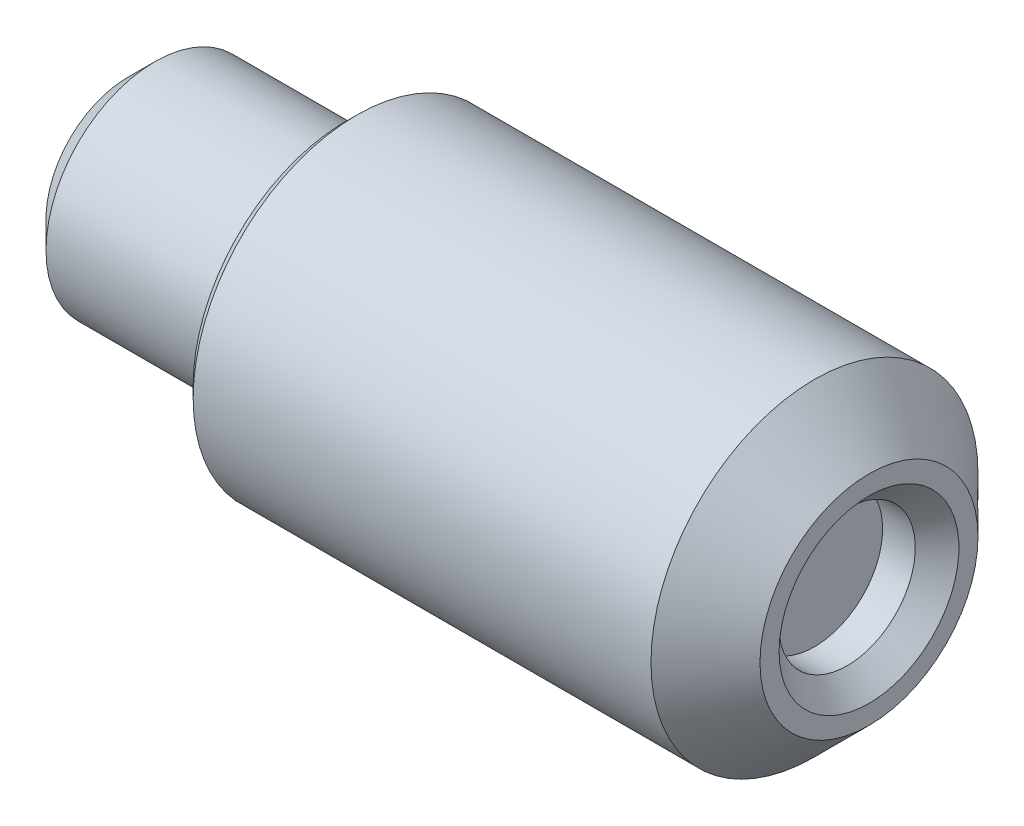
ISO-10303-21;
HEADER;
FILE_DESCRIPTION(('STEP AP214'),'2;1');
FILE_NAME('part.step','',(''),(''),'','','');
FILE_SCHEMA(('AUTOMOTIVE_DESIGN { 1 0 10303 214 1 1 1 1 }'));
ENDSEC;
DATA;
#1=APPLICATION_CONTEXT('core data for automotive mechanical design processes');
#2=APPLICATION_PROTOCOL_DEFINITION('international standard','automotive_design',2000,#1);
#3=PRODUCT_CONTEXT('',#1,'mechanical');
#4=PRODUCT('Part','Part','',(#3));
#5=PRODUCT_RELATED_PRODUCT_CATEGORY('part','',(#4));
#6=PRODUCT_DEFINITION_FORMATION('','',#4);
#7=PRODUCT_DEFINITION_CONTEXT('part definition',#1,'design');
#8=PRODUCT_DEFINITION('design','',#6,#7);
#9=PRODUCT_DEFINITION_SHAPE('','',#8);
#10=(LENGTH_UNIT() NAMED_UNIT(*) SI_UNIT(.MILLI.,.METRE.));
#11=(NAMED_UNIT(*) PLANE_ANGLE_UNIT() SI_UNIT($,.RADIAN.));
#12=(NAMED_UNIT(*) SI_UNIT($,.STERADIAN.) SOLID_ANGLE_UNIT());
#13=UNCERTAINTY_MEASURE_WITH_UNIT(LENGTH_MEASURE(1.E-05),#10,'distance_accuracy_value','');
#14=(GEOMETRIC_REPRESENTATION_CONTEXT(3) GLOBAL_UNCERTAINTY_ASSIGNED_CONTEXT((#13)) GLOBAL_UNIT_ASSIGNED_CONTEXT((#10,
#11,#12)) REPRESENTATION_CONTEXT('',''));
#15=CARTESIAN_POINT('',(0.,0.,0.));
#16=DIRECTION('',(0.,0.,1.));
#17=DIRECTION('',(1.,0.,0.));
#18=AXIS2_PLACEMENT_3D('',#15,#16,#17);
#19=CARTESIAN_POINT('',(-13.6,2.,0.));
#20=DIRECTION('',(1.,0.,0.));
#21=DIRECTION('',(0.,0.,-1.));
#22=AXIS2_PLACEMENT_3D('',#19,#20,#21);
#23=PLANE('',#22);
#24=CARTESIAN_POINT('',(-13.6,0.,0.));
#25=DIRECTION('',(1.,0.,0.));
#26=DIRECTION('',(0.,0.,-1.));
#27=AXIS2_PLACEMENT_3D('',#24,#25,#26);
#28=CIRCLE('',#27,1.5);
#29=CARTESIAN_POINT('',(-13.6,0.,-1.5));
#30=VERTEX_POINT('',#29);
#31=EDGE_CURVE('E31',#30,#30,#28,.F.);
#32=ORIENTED_EDGE('',*,*,#31,.T.);
#33=EDGE_LOOP('',(#32));
#34=FACE_BOUND('',#33,.T.);
#35=ADVANCED_FACE('F25',(#34),#23,.F.);
#36=CARTESIAN_POINT('',(0.,0.,0.));
#37=DIRECTION('',(-1.,0.,0.));
#38=DIRECTION('',(0.,0.,1.));
#39=AXIS2_PLACEMENT_3D('',#36,#37,#38);
#40=CYLINDRICAL_SURFACE('',#39,2.);
#41=CARTESIAN_POINT('',(-13.1,0.,0.));
#42=DIRECTION('',(1.,0.,0.));
#43=DIRECTION('',(0.,0.,-1.));
#44=AXIS2_PLACEMENT_3D('',#41,#42,#43);
#45=CIRCLE('',#44,2.);
#46=CARTESIAN_POINT('',(-13.1,0.,-2.));
#47=VERTEX_POINT('',#46);
#48=EDGE_CURVE('E10',#47,#47,#45,.T.);
#49=ORIENTED_EDGE('',*,*,#48,.T.);
#50=EDGE_LOOP('',(#49));
#51=FACE_BOUND('',#50,.T.);
#52=CARTESIAN_POINT('',(-9.6,0.,0.));
#53=DIRECTION('',(-1.,0.,0.));
#54=DIRECTION('',(0.,0.,1.));
#55=AXIS2_PLACEMENT_3D('',#52,#53,#54);
#56=CIRCLE('',#55,2.);
#57=CARTESIAN_POINT('',(-9.6,0.,2.));
#58=VERTEX_POINT('',#57);
#59=EDGE_CURVE('E56',#58,#58,#56,.T.);
#60=ORIENTED_EDGE('',*,*,#59,.T.);
#61=EDGE_LOOP('',(#60));
#62=FACE_BOUND('',#61,.T.);
#63=ADVANCED_FACE('F80',(#51,#62),#40,.T.);
#64=CARTESIAN_POINT('',(-9.6,3.,0.));
#65=DIRECTION('',(1.,0.,0.));
#66=DIRECTION('',(0.,0.,-1.));
#67=AXIS2_PLACEMENT_3D('',#64,#65,#66);
#68=PLANE('',#67);
#69=CARTESIAN_POINT('',(-9.6,0.,0.));
#70=DIRECTION('',(1.,0.,0.));
#71=DIRECTION('',(0.,0.,-1.));
#72=AXIS2_PLACEMENT_3D('',#69,#70,#71);
#73=CIRCLE('',#72,2.8);
#74=CARTESIAN_POINT('',(-9.6,0.,-2.8));
#75=VERTEX_POINT('',#74);
#76=EDGE_CURVE('E39',#75,#75,#73,.F.);
#77=ORIENTED_EDGE('',*,*,#76,.T.);
#78=EDGE_LOOP('',(#77));
#79=FACE_BOUND('',#78,.T.);
#80=ORIENTED_EDGE('',*,*,#59,.F.);
#81=EDGE_LOOP('',(#80));
#82=FACE_BOUND('',#81,.T.);
#83=ADVANCED_FACE('F85',(#79,#82),#68,.F.);
#84=CARTESIAN_POINT('',(0.,0.,0.));
#85=DIRECTION('',(-1.,0.,0.));
#86=DIRECTION('',(0.,0.,1.));
#87=AXIS2_PLACEMENT_3D('',#84,#85,#86);
#88=CYLINDRICAL_SURFACE('',#87,3.);
#89=CARTESIAN_POINT('',(-9.4,0.,0.));
#90=DIRECTION('',(1.,0.,0.));
#91=DIRECTION('',(0.,0.,-1.));
#92=AXIS2_PLACEMENT_3D('',#89,#90,#91);
#93=CIRCLE('',#92,3.);
#94=CARTESIAN_POINT('',(-9.4,0.,-3.));
#95=VERTEX_POINT('',#94);
#96=EDGE_CURVE('E35',#95,#95,#93,.T.);
#97=ORIENTED_EDGE('',*,*,#96,.T.);
#98=EDGE_LOOP('',(#97));
#99=FACE_BOUND('',#98,.T.);
#100=CARTESIAN_POINT('',(-1.,0.,0.));
#101=DIRECTION('',(-1.,0.,0.));
#102=DIRECTION('',(0.,0.,1.));
#103=AXIS2_PLACEMENT_3D('',#100,#101,#102);
#104=CIRCLE('',#103,3.);
#105=CARTESIAN_POINT('',(-1.,0.,3.));
#106=VERTEX_POINT('',#105);
#107=EDGE_CURVE('E53',#106,#106,#104,.T.);
#108=ORIENTED_EDGE('',*,*,#107,.T.);
#109=EDGE_LOOP('',(#108));
#110=FACE_BOUND('',#109,.T.);
#111=ADVANCED_FACE('F90',(#99,#110),#88,.T.);
#112=CARTESIAN_POINT('',(0.,3.,0.));
#113=DIRECTION('',(-1.,0.,0.));
#114=DIRECTION('',(0.,0.,1.));
#115=AXIS2_PLACEMENT_3D('',#112,#113,#114);
#116=PLANE('',#115);
#117=CARTESIAN_POINT('',(0.,0.,0.));
#118=DIRECTION('',(-1.,0.,0.));
#119=DIRECTION('',(0.,0.,1.));
#120=AXIS2_PLACEMENT_3D('',#117,#118,#119);
#121=CIRCLE('',#120,1.65);
#122=CARTESIAN_POINT('',(0.,0.,1.65));
#123=VERTEX_POINT('',#122);
#124=EDGE_CURVE('E47',#123,#123,#121,.T.);
#125=ORIENTED_EDGE('',*,*,#124,.T.);
#126=EDGE_LOOP('',(#125));
#127=FACE_BOUND('',#126,.T.);
#128=CARTESIAN_POINT('',(0.,0.,0.));
#129=DIRECTION('',(-1.,0.,0.));
#130=DIRECTION('',(0.,0.,1.));
#131=AXIS2_PLACEMENT_3D('',#128,#129,#130);
#132=CIRCLE('',#131,2.);
#133=CARTESIAN_POINT('',(0.,0.,2.));
#134=VERTEX_POINT('',#133);
#135=EDGE_CURVE('E50',#134,#134,#132,.F.);
#136=ORIENTED_EDGE('',*,*,#135,.T.);
#137=EDGE_LOOP('',(#136));
#138=FACE_BOUND('',#137,.T.);
#139=ADVANCED_FACE('F76',(#127,#138),#116,.F.);
#140=CARTESIAN_POINT('',(0.,0.,0.));
#141=DIRECTION('',(-1.,0.,0.));
#142=DIRECTION('',(0.,0.,1.));
#143=AXIS2_PLACEMENT_3D('',#140,#141,#142);
#144=CYLINDRICAL_SURFACE('',#143,1.25);
#145=CARTESIAN_POINT('',(-0.399999999999999,0.,0.));
#146=DIRECTION('',(-1.,0.,0.));
#147=DIRECTION('',(0.,0.,1.));
#148=AXIS2_PLACEMENT_3D('',#145,#146,#147);
#149=CIRCLE('',#148,1.25);
#150=CARTESIAN_POINT('',(-0.399999999999999,0.,1.25));
#151=VERTEX_POINT('',#150);
#152=EDGE_CURVE('E44',#151,#151,#149,.F.);
#153=ORIENTED_EDGE('',*,*,#152,.T.);
#154=EDGE_LOOP('',(#153));
#155=FACE_BOUND('',#154,.T.);
#156=CARTESIAN_POINT('',(-1.,0.,0.));
#157=DIRECTION('',(-1.,0.,0.));
#158=DIRECTION('',(0.,0.,1.));
#159=AXIS2_PLACEMENT_3D('',#156,#157,#158);
#160=CIRCLE('',#159,1.25);
#161=CARTESIAN_POINT('',(-1.,0.,1.25));
#162=VERTEX_POINT('',#161);
#163=EDGE_CURVE('E59',#162,#162,#160,.T.);
#164=ORIENTED_EDGE('',*,*,#163,.T.);
#165=EDGE_LOOP('',(#164));
#166=FACE_BOUND('',#165,.T.);
#167=ADVANCED_FACE('F63',(#155,#166),#144,.F.);
#168=CARTESIAN_POINT('',(-1.,0.,0.));
#169=DIRECTION('',(-1.,0.,0.));
#170=DIRECTION('',(0.,0.,1.));
#171=AXIS2_PLACEMENT_3D('',#168,#169,#170);
#172=PLANE('',#171);
#173=ORIENTED_EDGE('',*,*,#163,.F.);
#174=EDGE_LOOP('',(#173));
#175=FACE_BOUND('',#174,.T.);
#176=ADVANCED_FACE('F65',(#175),#172,.F.);
#177=CARTESIAN_POINT('',(-1.,0.,0.));
#178=DIRECTION('',(-1.,0.,0.));
#179=DIRECTION('',(0.,0.,1.));
#180=AXIS2_PLACEMENT_3D('',#177,#178,#179);
#181=CONICAL_SURFACE('',#180,3.,0.785398163397451);
#182=ORIENTED_EDGE('',*,*,#135,.F.);
#183=EDGE_LOOP('',(#182));
#184=FACE_BOUND('',#183,.T.);
#185=ORIENTED_EDGE('',*,*,#107,.F.);
#186=EDGE_LOOP('',(#185));
#187=FACE_BOUND('',#186,.T.);
#188=ADVANCED_FACE('F67',(#184,#187),#181,.T.);
#189=CARTESIAN_POINT('',(0.,0.,0.));
#190=DIRECTION('',(1.,0.,0.));
#191=DIRECTION('',(0.,0.,-1.));
#192=AXIS2_PLACEMENT_3D('',#189,#190,#191);
#193=CONICAL_SURFACE('',#192,1.65,0.785398163397449);
#194=ORIENTED_EDGE('',*,*,#152,.F.);
#195=EDGE_LOOP('',(#194));
#196=FACE_BOUND('',#195,.T.);
#197=ORIENTED_EDGE('',*,*,#124,.F.);
#198=EDGE_LOOP('',(#197));
#199=FACE_BOUND('',#198,.T.);
#200=ADVANCED_FACE('F72',(#196,#199),#193,.F.);
#201=CARTESIAN_POINT('',(-9.6,0.,0.));
#202=DIRECTION('',(1.,0.,0.));
#203=DIRECTION('',(0.,0.,-1.));
#204=AXIS2_PLACEMENT_3D('',#201,#202,#203);
#205=CONICAL_SURFACE('',#204,2.8,0.785398163397449);
#206=ORIENTED_EDGE('',*,*,#96,.F.);
#207=EDGE_LOOP('',(#206));
#208=FACE_BOUND('',#207,.T.);
#209=ORIENTED_EDGE('',*,*,#76,.F.);
#210=EDGE_LOOP('',(#209));
#211=FACE_BOUND('',#210,.T.);
#212=ADVANCED_FACE('F110',(#208,#211),#205,.T.);
#213=CARTESIAN_POINT('',(-13.6,0.,0.));
#214=DIRECTION('',(1.,0.,0.));
#215=DIRECTION('',(0.,0.,-1.));
#216=AXIS2_PLACEMENT_3D('',#213,#214,#215);
#217=CONICAL_SURFACE('',#216,1.5,0.785398163397447);
#218=ORIENTED_EDGE('',*,*,#48,.F.);
#219=EDGE_LOOP('',(#218));
#220=FACE_BOUND('',#219,.T.);
#221=ORIENTED_EDGE('',*,*,#31,.F.);
#222=EDGE_LOOP('',(#221));
#223=FACE_BOUND('',#222,.T.);
#224=ADVANCED_FACE('F115',(#220,#223),#217,.T.);
#225=CLOSED_SHELL('',(#35,#63,#83,#111,#139,#167,#176,#188,#200,#212,#224));
#226=MANIFOLD_SOLID_BREP('B2',#225);
#227=ADVANCED_BREP_SHAPE_REPRESENTATION('',(#18,#226),#14);
#228=SHAPE_DEFINITION_REPRESENTATION(#9,#227);
ENDSEC;
END-ISO-10303-21;
